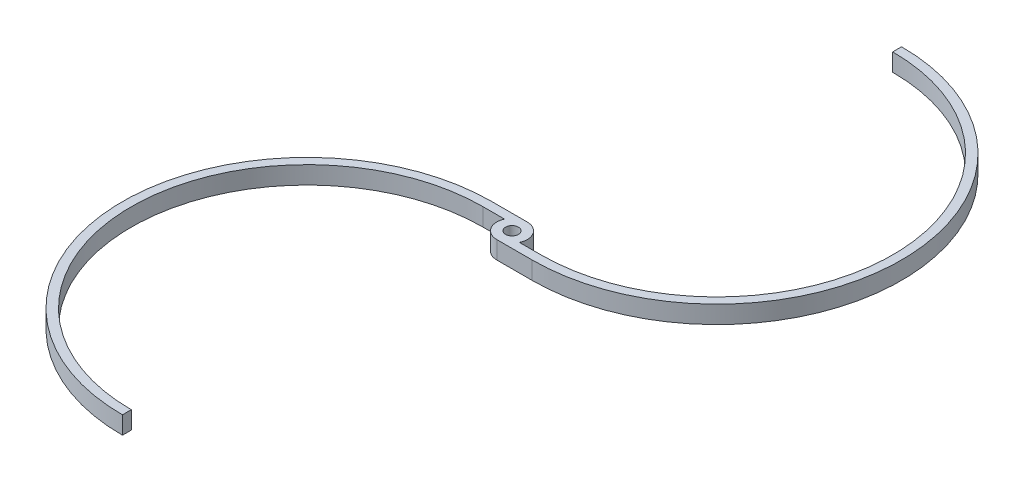
ISO-10303-21;
HEADER;
FILE_DESCRIPTION(('STEP AP214'),'2;1');
FILE_NAME('part.step','',(''),(''),'','','');
FILE_SCHEMA(('AUTOMOTIVE_DESIGN { 1 0 10303 214 1 1 1 1 }'));
ENDSEC;
DATA;
#1=APPLICATION_CONTEXT('core data for automotive mechanical design processes');
#2=APPLICATION_PROTOCOL_DEFINITION('international standard','automotive_design',2000,#1);
#3=PRODUCT_CONTEXT('',#1,'mechanical');
#4=PRODUCT('Part','Part','',(#3));
#5=PRODUCT_RELATED_PRODUCT_CATEGORY('part','',(#4));
#6=PRODUCT_DEFINITION_FORMATION('','',#4);
#7=PRODUCT_DEFINITION_CONTEXT('part definition',#1,'design');
#8=PRODUCT_DEFINITION('design','',#6,#7);
#9=PRODUCT_DEFINITION_SHAPE('','',#8);
#10=(LENGTH_UNIT() NAMED_UNIT(*) SI_UNIT(.MILLI.,.METRE.));
#11=(NAMED_UNIT(*) PLANE_ANGLE_UNIT() SI_UNIT($,.RADIAN.));
#12=(NAMED_UNIT(*) SI_UNIT($,.STERADIAN.) SOLID_ANGLE_UNIT());
#13=UNCERTAINTY_MEASURE_WITH_UNIT(LENGTH_MEASURE(1.E-05),#10,'distance_accuracy_value','');
#14=(GEOMETRIC_REPRESENTATION_CONTEXT(3) GLOBAL_UNCERTAINTY_ASSIGNED_CONTEXT((#13)) GLOBAL_UNIT_ASSIGNED_CONTEXT((#10,
#11,#12)) REPRESENTATION_CONTEXT('',''));
#15=CARTESIAN_POINT('',(0.,0.,0.));
#16=DIRECTION('',(0.,0.,1.));
#17=DIRECTION('',(1.,0.,0.));
#18=AXIS2_PLACEMENT_3D('',#15,#16,#17);
#19=CARTESIAN_POINT('',(50.,25.,-239.25));
#20=DIRECTION('',(0.,1.,0.));
#21=DIRECTION('',(0.,0.,1.));
#22=AXIS2_PLACEMENT_3D('',#19,#20,#21);
#23=PLANE('',#22);
#24=CARTESIAN_POINT('',(50.,25.,-239.25));
#25=DIRECTION('',(0.,-1.,0.));
#26=DIRECTION('',(0.,0.,1.));
#27=AXIS2_PLACEMENT_3D('',#24,#25,#26);
#28=CIRCLE('',#27,248.25);
#29=CARTESIAN_POINT('',(49.9999999999982,25.,-487.5));
#30=VERTEX_POINT('',#29);
#31=CARTESIAN_POINT('',(50.,25.,9.));
#32=VERTEX_POINT('',#31);
#33=EDGE_CURVE('E181',#30,#32,#28,.T.);
#34=ORIENTED_EDGE('',*,*,#33,.T.);
#35=DIRECTION('',(-1.,0.,0.));
#36=VECTOR('',#35,1.);
#37=CARTESIAN_POINT('',(19.5256241897666,25.,9.));
#38=LINE('',#37,#36);
#39=CARTESIAN_POINT('',(19.5256241897666,25.,9.));
#40=VERTEX_POINT('',#39);
#41=EDGE_CURVE('E109',#32,#40,#38,.T.);
#42=ORIENTED_EDGE('',*,*,#41,.T.);
#43=CARTESIAN_POINT('',(0.,25.,0.));
#44=DIRECTION('',(0.,1.,0.));
#45=DIRECTION('',(0.,0.,1.));
#46=AXIS2_PLACEMENT_3D('',#43,#44,#45);
#47=CIRCLE('',#46,21.5);
#48=CARTESIAN_POINT('',(0.,25.,-21.5));
#49=VERTEX_POINT('',#48);
#50=EDGE_CURVE('E208',#40,#49,#47,.T.);
#51=ORIENTED_EDGE('',*,*,#50,.T.);
#52=DIRECTION('',(-1.,0.,0.));
#53=VECTOR('',#52,1.);
#54=CARTESIAN_POINT('',(0.,25.,-21.5));
#55=LINE('',#54,#53);
#56=CARTESIAN_POINT('',(-50.,25.,-21.5));
#57=VERTEX_POINT('',#56);
#58=EDGE_CURVE('E227',#49,#57,#55,.T.);
#59=ORIENTED_EDGE('',*,*,#58,.T.);
#60=CARTESIAN_POINT('',(-49.9999999999999,25.,239.25));
#61=DIRECTION('',(0.,1.,0.));
#62=DIRECTION('',(0.,0.,1.));
#63=AXIS2_PLACEMENT_3D('',#60,#61,#62);
#64=CIRCLE('',#63,260.75);
#65=CARTESIAN_POINT('',(-49.9999999999999,25.,500.));
#66=VERTEX_POINT('',#65);
#67=EDGE_CURVE('E224',#57,#66,#64,.T.);
#68=ORIENTED_EDGE('',*,*,#67,.T.);
#69=DIRECTION('',(0.,0.,-1.));
#70=VECTOR('',#69,1.);
#71=CARTESIAN_POINT('',(-49.9999999999983,25.,487.5));
#72=LINE('',#71,#70);
#73=CARTESIAN_POINT('',(-49.9999999999983,25.,487.5));
#74=VERTEX_POINT('',#73);
#75=EDGE_CURVE('E226',#66,#74,#72,.T.);
#76=ORIENTED_EDGE('',*,*,#75,.T.);
#77=CARTESIAN_POINT('',(-49.9999999999999,25.,239.25));
#78=DIRECTION('',(0.,-1.,0.));
#79=DIRECTION('',(0.,0.,1.));
#80=AXIS2_PLACEMENT_3D('',#77,#78,#79);
#81=CIRCLE('',#80,248.25);
#82=CARTESIAN_POINT('',(-50.,25.,-8.99999999999995));
#83=VERTEX_POINT('',#82);
#84=EDGE_CURVE('E229',#74,#83,#81,.T.);
#85=ORIENTED_EDGE('',*,*,#84,.T.);
#86=DIRECTION('',(1.,0.,0.));
#87=VECTOR('',#86,1.);
#88=CARTESIAN_POINT('',(-19.5256241897666,25.,-9.));
#89=LINE('',#88,#87);
#90=CARTESIAN_POINT('',(-19.5256241897666,25.,-9.));
#91=VERTEX_POINT('',#90);
#92=EDGE_CURVE('E235',#83,#91,#89,.T.);
#93=ORIENTED_EDGE('',*,*,#92,.T.);
#94=CARTESIAN_POINT('',(0.,25.,0.));
#95=DIRECTION('',(0.,1.,0.));
#96=DIRECTION('',(0.,0.,1.));
#97=AXIS2_PLACEMENT_3D('',#94,#95,#96);
#98=CIRCLE('',#97,21.5);
#99=CARTESIAN_POINT('',(0.,25.,21.5));
#100=VERTEX_POINT('',#99);
#101=EDGE_CURVE('E140',#91,#100,#98,.T.);
#102=ORIENTED_EDGE('',*,*,#101,.T.);
#103=DIRECTION('',(1.,0.,0.));
#104=VECTOR('',#103,1.);
#105=CARTESIAN_POINT('',(0.,25.,21.5));
#106=LINE('',#105,#104);
#107=CARTESIAN_POINT('',(50.,25.,21.5));
#108=VERTEX_POINT('',#107);
#109=EDGE_CURVE('E134',#100,#108,#106,.T.);
#110=ORIENTED_EDGE('',*,*,#109,.T.);
#111=CARTESIAN_POINT('',(50.,25.,-239.25));
#112=DIRECTION('',(0.,1.,0.));
#113=DIRECTION('',(0.,0.,1.));
#114=AXIS2_PLACEMENT_3D('',#111,#112,#113);
#115=CIRCLE('',#114,260.75);
#116=CARTESIAN_POINT('',(49.9999999999983,25.,-500.));
#117=VERTEX_POINT('',#116);
#118=EDGE_CURVE('E138',#108,#117,#115,.T.);
#119=ORIENTED_EDGE('',*,*,#118,.T.);
#120=DIRECTION('',(0.,0.,1.));
#121=VECTOR('',#120,1.);
#122=CARTESIAN_POINT('',(49.9999999999982,25.,-487.5));
#123=LINE('',#122,#121);
#124=EDGE_CURVE('E54',#117,#30,#123,.T.);
#125=ORIENTED_EDGE('',*,*,#124,.T.);
#126=EDGE_LOOP('',(#34,#42,#51,#59,#68,#76,#85,#93,#102,#110,#119,#125));
#127=FACE_BOUND('',#126,.T.);
#128=CARTESIAN_POINT('',(0.,25.,0.));
#129=DIRECTION('',(0.,1.,0.));
#130=DIRECTION('',(0.,0.,1.));
#131=AXIS2_PLACEMENT_3D('',#128,#129,#130);
#132=CIRCLE('',#131,9.);
#133=CARTESIAN_POINT('',(0.,25.,9.));
#134=VERTEX_POINT('',#133);
#135=EDGE_CURVE('E162',#134,#134,#132,.T.);
#136=ORIENTED_EDGE('',*,*,#135,.F.);
#137=EDGE_LOOP('',(#136));
#138=FACE_BOUND('',#137,.T.);
#139=ADVANCED_FACE('F37',(#127,#138),#23,.T.);
#140=CARTESIAN_POINT('',(50.,0.,-239.25));
#141=DIRECTION('',(0.,1.,0.));
#142=DIRECTION('',(0.,0.,1.));
#143=AXIS2_PLACEMENT_3D('',#140,#141,#142);
#144=PLANE('',#143);
#145=CARTESIAN_POINT('',(50.,0.,-239.25));
#146=DIRECTION('',(0.,-1.,0.));
#147=DIRECTION('',(0.,0.,1.));
#148=AXIS2_PLACEMENT_3D('',#145,#146,#147);
#149=CIRCLE('',#148,248.25);
#150=CARTESIAN_POINT('',(49.9999999999982,0.,-487.5));
#151=VERTEX_POINT('',#150);
#152=CARTESIAN_POINT('',(50.,0.,9.));
#153=VERTEX_POINT('',#152);
#154=EDGE_CURVE('E158',#151,#153,#149,.T.);
#155=ORIENTED_EDGE('',*,*,#154,.F.);
#156=DIRECTION('',(0.,0.,1.));
#157=VECTOR('',#156,1.);
#158=CARTESIAN_POINT('',(49.9999999999982,0.,-487.5));
#159=LINE('',#158,#157);
#160=CARTESIAN_POINT('',(49.9999999999983,0.,-500.));
#161=VERTEX_POINT('',#160);
#162=EDGE_CURVE('E101',#161,#151,#159,.T.);
#163=ORIENTED_EDGE('',*,*,#162,.F.);
#164=CARTESIAN_POINT('',(50.,0.,-239.25));
#165=DIRECTION('',(0.,1.,0.));
#166=DIRECTION('',(0.,0.,1.));
#167=AXIS2_PLACEMENT_3D('',#164,#165,#166);
#168=CIRCLE('',#167,260.75);
#169=CARTESIAN_POINT('',(50.,0.,21.5));
#170=VERTEX_POINT('',#169);
#171=EDGE_CURVE('E95',#170,#161,#168,.T.);
#172=ORIENTED_EDGE('',*,*,#171,.F.);
#173=DIRECTION('',(1.,0.,0.));
#174=VECTOR('',#173,1.);
#175=CARTESIAN_POINT('',(0.,0.,21.5));
#176=LINE('',#175,#174);
#177=CARTESIAN_POINT('',(0.,0.,21.5));
#178=VERTEX_POINT('',#177);
#179=EDGE_CURVE('E148',#178,#170,#176,.T.);
#180=ORIENTED_EDGE('',*,*,#179,.F.);
#181=CARTESIAN_POINT('',(0.,0.,0.));
#182=DIRECTION('',(0.,1.,0.));
#183=DIRECTION('',(0.,0.,1.));
#184=AXIS2_PLACEMENT_3D('',#181,#182,#183);
#185=CIRCLE('',#184,21.5);
#186=CARTESIAN_POINT('',(-19.5256241897666,0.,-9.));
#187=VERTEX_POINT('',#186);
#188=EDGE_CURVE('E176',#187,#178,#185,.T.);
#189=ORIENTED_EDGE('',*,*,#188,.F.);
#190=DIRECTION('',(1.,0.,0.));
#191=VECTOR('',#190,1.);
#192=CARTESIAN_POINT('',(-19.5256241897666,0.,-9.));
#193=LINE('',#192,#191);
#194=CARTESIAN_POINT('',(-50.,0.,-8.99999999999995));
#195=VERTEX_POINT('',#194);
#196=EDGE_CURVE('E174',#195,#187,#193,.T.);
#197=ORIENTED_EDGE('',*,*,#196,.F.);
#198=CARTESIAN_POINT('',(-49.9999999999999,0.,239.25));
#199=DIRECTION('',(0.,-1.,0.));
#200=DIRECTION('',(0.,0.,1.));
#201=AXIS2_PLACEMENT_3D('',#198,#199,#200);
#202=CIRCLE('',#201,248.25);
#203=CARTESIAN_POINT('',(-49.9999999999983,0.,487.5));
#204=VERTEX_POINT('',#203);
#205=EDGE_CURVE('E172',#204,#195,#202,.T.);
#206=ORIENTED_EDGE('',*,*,#205,.F.);
#207=DIRECTION('',(0.,0.,-1.));
#208=VECTOR('',#207,1.);
#209=CARTESIAN_POINT('',(-49.9999999999983,0.,487.5));
#210=LINE('',#209,#208);
#211=CARTESIAN_POINT('',(-49.9999999999999,0.,500.));
#212=VERTEX_POINT('',#211);
#213=EDGE_CURVE('E170',#212,#204,#210,.T.);
#214=ORIENTED_EDGE('',*,*,#213,.F.);
#215=CARTESIAN_POINT('',(-49.9999999999999,0.,239.25));
#216=DIRECTION('',(0.,1.,0.));
#217=DIRECTION('',(0.,0.,1.));
#218=AXIS2_PLACEMENT_3D('',#215,#216,#217);
#219=CIRCLE('',#218,260.75);
#220=CARTESIAN_POINT('',(-50.,0.,-21.5));
#221=VERTEX_POINT('',#220);
#222=EDGE_CURVE('E168',#221,#212,#219,.T.);
#223=ORIENTED_EDGE('',*,*,#222,.F.);
#224=DIRECTION('',(-1.,0.,0.));
#225=VECTOR('',#224,1.);
#226=CARTESIAN_POINT('',(0.,0.,-21.5));
#227=LINE('',#226,#225);
#228=CARTESIAN_POINT('',(0.,0.,-21.5));
#229=VERTEX_POINT('',#228);
#230=EDGE_CURVE('E166',#229,#221,#227,.T.);
#231=ORIENTED_EDGE('',*,*,#230,.F.);
#232=CARTESIAN_POINT('',(0.,0.,0.));
#233=DIRECTION('',(0.,1.,0.));
#234=DIRECTION('',(0.,0.,1.));
#235=AXIS2_PLACEMENT_3D('',#232,#233,#234);
#236=CIRCLE('',#235,21.5);
#237=CARTESIAN_POINT('',(19.5256241897666,0.,9.));
#238=VERTEX_POINT('',#237);
#239=EDGE_CURVE('E164',#238,#229,#236,.T.);
#240=ORIENTED_EDGE('',*,*,#239,.F.);
#241=DIRECTION('',(-1.,0.,0.));
#242=VECTOR('',#241,1.);
#243=CARTESIAN_POINT('',(19.5256241897666,0.,9.));
#244=LINE('',#243,#242);
#245=EDGE_CURVE('E161',#153,#238,#244,.T.);
#246=ORIENTED_EDGE('',*,*,#245,.F.);
#247=EDGE_LOOP('',(#155,#163,#172,#180,#189,#197,#206,#214,#223,#231,#240,#246));
#248=FACE_BOUND('',#247,.T.);
#249=CARTESIAN_POINT('',(0.,0.,0.));
#250=DIRECTION('',(0.,1.,0.));
#251=DIRECTION('',(0.,0.,1.));
#252=AXIS2_PLACEMENT_3D('',#249,#250,#251);
#253=CIRCLE('',#252,9.);
#254=CARTESIAN_POINT('',(0.,0.,9.));
#255=VERTEX_POINT('',#254);
#256=EDGE_CURVE('E382',#255,#255,#253,.T.);
#257=ORIENTED_EDGE('',*,*,#256,.T.);
#258=EDGE_LOOP('',(#257));
#259=FACE_BOUND('',#258,.T.);
#260=ADVANCED_FACE('F212',(#248,#259),#144,.F.);
#261=CARTESIAN_POINT('',(50.,25.,-239.25));
#262=DIRECTION('',(0.,-1.,0.));
#263=DIRECTION('',(0.,0.,-1.));
#264=AXIS2_PLACEMENT_3D('',#261,#262,#263);
#265=CYLINDRICAL_SURFACE('',#264,248.25);
#266=ORIENTED_EDGE('',*,*,#154,.T.);
#267=DIRECTION('',(0.,-1.,0.));
#268=VECTOR('',#267,1.);
#269=CARTESIAN_POINT('',(50.,25.,9.));
#270=LINE('',#269,#268);
#271=EDGE_CURVE('E11',#32,#153,#270,.T.);
#272=ORIENTED_EDGE('',*,*,#271,.F.);
#273=ORIENTED_EDGE('',*,*,#33,.F.);
#274=DIRECTION('',(0.,-1.,0.));
#275=VECTOR('',#274,1.);
#276=CARTESIAN_POINT('',(49.9999999999982,25.,-487.5));
#277=LINE('',#276,#275);
#278=EDGE_CURVE('E154',#30,#151,#277,.T.);
#279=ORIENTED_EDGE('',*,*,#278,.T.);
#280=EDGE_LOOP('',(#266,#272,#273,#279));
#281=FACE_BOUND('',#280,.T.);
#282=ADVANCED_FACE('F39',(#281),#265,.F.);
#283=CARTESIAN_POINT('',(19.5256241897666,25.,9.));
#284=DIRECTION('',(0.,0.,1.));
#285=DIRECTION('',(1.,0.,0.));
#286=AXIS2_PLACEMENT_3D('',#283,#284,#285);
#287=PLANE('',#286);
#288=ORIENTED_EDGE('',*,*,#245,.T.);
#289=DIRECTION('',(0.,-1.,0.));
#290=VECTOR('',#289,1.);
#291=CARTESIAN_POINT('',(19.5256241897666,25.,9.));
#292=LINE('',#291,#290);
#293=EDGE_CURVE('E46',#40,#238,#292,.T.);
#294=ORIENTED_EDGE('',*,*,#293,.F.);
#295=ORIENTED_EDGE('',*,*,#41,.F.);
#296=ORIENTED_EDGE('',*,*,#271,.T.);
#297=EDGE_LOOP('',(#288,#294,#295,#296));
#298=FACE_BOUND('',#297,.T.);
#299=ADVANCED_FACE('F269',(#298),#287,.F.);
#300=CARTESIAN_POINT('',(0.,25.,0.));
#301=DIRECTION('',(0.,-1.,0.));
#302=DIRECTION('',(0.,0.,-1.));
#303=AXIS2_PLACEMENT_3D('',#300,#301,#302);
#304=CYLINDRICAL_SURFACE('',#303,21.5);
#305=ORIENTED_EDGE('',*,*,#239,.T.);
#306=DIRECTION('',(0.,-1.,0.));
#307=VECTOR('',#306,1.);
#308=CARTESIAN_POINT('',(0.,25.,-21.5));
#309=LINE('',#308,#307);
#310=EDGE_CURVE('E200',#49,#229,#309,.T.);
#311=ORIENTED_EDGE('',*,*,#310,.F.);
#312=ORIENTED_EDGE('',*,*,#50,.F.);
#313=ORIENTED_EDGE('',*,*,#293,.T.);
#314=EDGE_LOOP('',(#305,#311,#312,#313));
#315=FACE_BOUND('',#314,.T.);
#316=ADVANCED_FACE('F206',(#315),#304,.T.);
#317=CARTESIAN_POINT('',(0.,25.,-21.5));
#318=DIRECTION('',(0.,0.,1.));
#319=DIRECTION('',(1.,0.,0.));
#320=AXIS2_PLACEMENT_3D('',#317,#318,#319);
#321=PLANE('',#320);
#322=ORIENTED_EDGE('',*,*,#230,.T.);
#323=DIRECTION('',(0.,-1.,0.));
#324=VECTOR('',#323,1.);
#325=CARTESIAN_POINT('',(-50.,25.,-21.5));
#326=LINE('',#325,#324);
#327=EDGE_CURVE('E197',#57,#221,#326,.T.);
#328=ORIENTED_EDGE('',*,*,#327,.F.);
#329=ORIENTED_EDGE('',*,*,#58,.F.);
#330=ORIENTED_EDGE('',*,*,#310,.T.);
#331=EDGE_LOOP('',(#322,#328,#329,#330));
#332=FACE_BOUND('',#331,.T.);
#333=ADVANCED_FACE('F218',(#332),#321,.F.);
#334=CARTESIAN_POINT('',(-49.9999999999999,25.,239.25));
#335=DIRECTION('',(0.,-1.,0.));
#336=DIRECTION('',(0.,0.,-1.));
#337=AXIS2_PLACEMENT_3D('',#334,#335,#336);
#338=CYLINDRICAL_SURFACE('',#337,260.75);
#339=ORIENTED_EDGE('',*,*,#222,.T.);
#340=DIRECTION('',(0.,-1.,0.));
#341=VECTOR('',#340,1.);
#342=CARTESIAN_POINT('',(-49.9999999999999,25.,500.));
#343=LINE('',#342,#341);
#344=EDGE_CURVE('E194',#66,#212,#343,.T.);
#345=ORIENTED_EDGE('',*,*,#344,.F.);
#346=ORIENTED_EDGE('',*,*,#67,.F.);
#347=ORIENTED_EDGE('',*,*,#327,.T.);
#348=EDGE_LOOP('',(#339,#345,#346,#347));
#349=FACE_BOUND('',#348,.T.);
#350=ADVANCED_FACE('F222',(#349),#338,.T.);
#351=CARTESIAN_POINT('',(-49.9999999999983,25.,487.5));
#352=DIRECTION('',(-1.,0.,0.));
#353=DIRECTION('',(0.,0.,1.));
#354=AXIS2_PLACEMENT_3D('',#351,#352,#353);
#355=PLANE('',#354);
#356=ORIENTED_EDGE('',*,*,#213,.T.);
#357=DIRECTION('',(0.,-1.,0.));
#358=VECTOR('',#357,1.);
#359=CARTESIAN_POINT('',(-49.9999999999983,25.,487.5));
#360=LINE('',#359,#358);
#361=EDGE_CURVE('E191',#74,#204,#360,.T.);
#362=ORIENTED_EDGE('',*,*,#361,.F.);
#363=ORIENTED_EDGE('',*,*,#75,.F.);
#364=ORIENTED_EDGE('',*,*,#344,.T.);
#365=EDGE_LOOP('',(#356,#362,#363,#364));
#366=FACE_BOUND('',#365,.T.);
#367=ADVANCED_FACE('F282',(#366),#355,.F.);
#368=CARTESIAN_POINT('',(-49.9999999999999,25.,239.25));
#369=DIRECTION('',(0.,-1.,0.));
#370=DIRECTION('',(0.,0.,-1.));
#371=AXIS2_PLACEMENT_3D('',#368,#369,#370);
#372=CYLINDRICAL_SURFACE('',#371,248.25);
#373=ORIENTED_EDGE('',*,*,#205,.T.);
#374=DIRECTION('',(0.,-1.,0.));
#375=VECTOR('',#374,1.);
#376=CARTESIAN_POINT('',(-50.,25.,-8.99999999999995));
#377=LINE('',#376,#375);
#378=EDGE_CURVE('E188',#83,#195,#377,.T.);
#379=ORIENTED_EDGE('',*,*,#378,.F.);
#380=ORIENTED_EDGE('',*,*,#84,.F.);
#381=ORIENTED_EDGE('',*,*,#361,.T.);
#382=EDGE_LOOP('',(#373,#379,#380,#381));
#383=FACE_BOUND('',#382,.T.);
#384=ADVANCED_FACE('F285',(#383),#372,.F.);
#385=CARTESIAN_POINT('',(-19.5256241897666,25.,-9.));
#386=DIRECTION('',(0.,0.,-1.));
#387=DIRECTION('',(-1.,0.,0.));
#388=AXIS2_PLACEMENT_3D('',#385,#386,#387);
#389=PLANE('',#388);
#390=ORIENTED_EDGE('',*,*,#196,.T.);
#391=DIRECTION('',(0.,-1.,0.));
#392=VECTOR('',#391,1.);
#393=CARTESIAN_POINT('',(-19.5256241897666,25.,-9.));
#394=LINE('',#393,#392);
#395=EDGE_CURVE('E185',#91,#187,#394,.T.);
#396=ORIENTED_EDGE('',*,*,#395,.F.);
#397=ORIENTED_EDGE('',*,*,#92,.F.);
#398=ORIENTED_EDGE('',*,*,#378,.T.);
#399=EDGE_LOOP('',(#390,#396,#397,#398));
#400=FACE_BOUND('',#399,.T.);
#401=ADVANCED_FACE('F241',(#400),#389,.F.);
#402=CARTESIAN_POINT('',(0.,25.,0.));
#403=DIRECTION('',(0.,-1.,0.));
#404=DIRECTION('',(0.,0.,-1.));
#405=AXIS2_PLACEMENT_3D('',#402,#403,#404);
#406=CYLINDRICAL_SURFACE('',#405,21.5);
#407=ORIENTED_EDGE('',*,*,#188,.T.);
#408=DIRECTION('',(0.,-1.,0.));
#409=VECTOR('',#408,1.);
#410=CARTESIAN_POINT('',(0.,25.,21.5));
#411=LINE('',#410,#409);
#412=EDGE_CURVE('E149',#100,#178,#411,.T.);
#413=ORIENTED_EDGE('',*,*,#412,.F.);
#414=ORIENTED_EDGE('',*,*,#101,.F.);
#415=ORIENTED_EDGE('',*,*,#395,.T.);
#416=EDGE_LOOP('',(#407,#413,#414,#415));
#417=FACE_BOUND('',#416,.T.);
#418=ADVANCED_FACE('F245',(#417),#406,.T.);
#419=CARTESIAN_POINT('',(0.,25.,21.5));
#420=DIRECTION('',(0.,0.,-1.));
#421=DIRECTION('',(-1.,0.,0.));
#422=AXIS2_PLACEMENT_3D('',#419,#420,#421);
#423=PLANE('',#422);
#424=ORIENTED_EDGE('',*,*,#179,.T.);
#425=DIRECTION('',(0.,-1.,0.));
#426=VECTOR('',#425,1.);
#427=CARTESIAN_POINT('',(50.,25.,21.5));
#428=LINE('',#427,#426);
#429=EDGE_CURVE('E145',#108,#170,#428,.T.);
#430=ORIENTED_EDGE('',*,*,#429,.F.);
#431=ORIENTED_EDGE('',*,*,#109,.F.);
#432=ORIENTED_EDGE('',*,*,#412,.T.);
#433=EDGE_LOOP('',(#424,#430,#431,#432));
#434=FACE_BOUND('',#433,.T.);
#435=ADVANCED_FACE('F146',(#434),#423,.F.);
#436=CARTESIAN_POINT('',(50.,25.,-239.25));
#437=DIRECTION('',(0.,-1.,0.));
#438=DIRECTION('',(0.,0.,-1.));
#439=AXIS2_PLACEMENT_3D('',#436,#437,#438);
#440=CYLINDRICAL_SURFACE('',#439,260.75);
#441=ORIENTED_EDGE('',*,*,#171,.T.);
#442=DIRECTION('',(0.,-1.,0.));
#443=VECTOR('',#442,1.);
#444=CARTESIAN_POINT('',(49.9999999999983,25.,-500.));
#445=LINE('',#444,#443);
#446=EDGE_CURVE('E150',#117,#161,#445,.T.);
#447=ORIENTED_EDGE('',*,*,#446,.F.);
#448=ORIENTED_EDGE('',*,*,#118,.F.);
#449=ORIENTED_EDGE('',*,*,#429,.T.);
#450=EDGE_LOOP('',(#441,#447,#448,#449));
#451=FACE_BOUND('',#450,.T.);
#452=ADVANCED_FACE('F152',(#451),#440,.T.);
#453=CARTESIAN_POINT('',(49.9999999999982,25.,-487.5));
#454=DIRECTION('',(1.,0.,0.));
#455=DIRECTION('',(0.,0.,-1.));
#456=AXIS2_PLACEMENT_3D('',#453,#454,#455);
#457=PLANE('',#456);
#458=ORIENTED_EDGE('',*,*,#162,.T.);
#459=ORIENTED_EDGE('',*,*,#278,.F.);
#460=ORIENTED_EDGE('',*,*,#124,.F.);
#461=ORIENTED_EDGE('',*,*,#446,.T.);
#462=EDGE_LOOP('',(#458,#459,#460,#461));
#463=FACE_BOUND('',#462,.T.);
#464=ADVANCED_FACE('F249',(#463),#457,.F.);
#465=CARTESIAN_POINT('',(0.,25.,0.));
#466=DIRECTION('',(0.,-1.,0.));
#467=DIRECTION('',(0.,0.,-1.));
#468=AXIS2_PLACEMENT_3D('',#465,#466,#467);
#469=CYLINDRICAL_SURFACE('',#468,9.);
#470=ORIENTED_EDGE('',*,*,#135,.T.);
#471=EDGE_LOOP('',(#470));
#472=FACE_BOUND('',#471,.T.);
#473=ORIENTED_EDGE('',*,*,#256,.F.);
#474=EDGE_LOOP('',(#473));
#475=FACE_BOUND('',#474,.T.);
#476=ADVANCED_FACE('F251',(#472,#475),#469,.F.);
#477=CLOSED_SHELL('',(#139,#260,#282,#299,#316,#333,#350,#367,#384,#401,#418,#435,#452,#464,#476));
#478=MANIFOLD_SOLID_BREP('B2',#477);
#479=ADVANCED_BREP_SHAPE_REPRESENTATION('',(#18,#478),#14);
#480=SHAPE_DEFINITION_REPRESENTATION(#9,#479);
ENDSEC;
END-ISO-10303-21;
